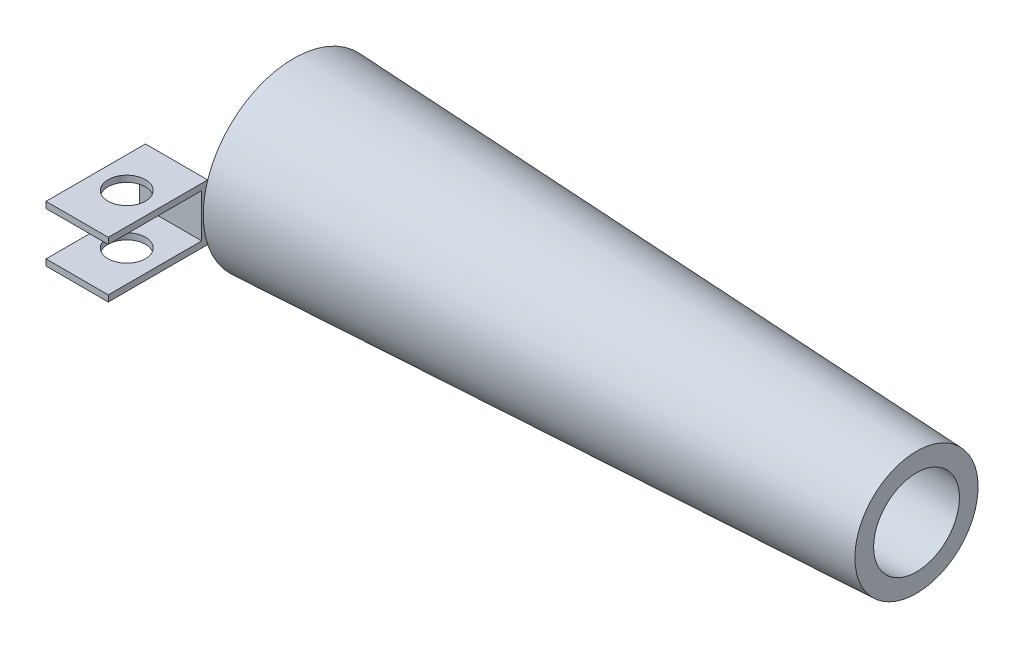
ISO-10303-21;
HEADER;
FILE_DESCRIPTION(('STEP AP214'),'2;1');
FILE_NAME('part.step','',(''),(''),'','','');
FILE_SCHEMA(('AUTOMOTIVE_DESIGN { 1 0 10303 214 1 1 1 1 }'));
ENDSEC;
DATA;
#1=APPLICATION_CONTEXT('core data for automotive mechanical design processes');
#2=APPLICATION_PROTOCOL_DEFINITION('international standard','automotive_design',2000,#1);
#3=PRODUCT_CONTEXT('',#1,'mechanical');
#4=PRODUCT('Part','Part','',(#3));
#5=PRODUCT_RELATED_PRODUCT_CATEGORY('part','',(#4));
#6=PRODUCT_DEFINITION_FORMATION('','',#4);
#7=PRODUCT_DEFINITION_CONTEXT('part definition',#1,'design');
#8=PRODUCT_DEFINITION('design','',#6,#7);
#9=PRODUCT_DEFINITION_SHAPE('','',#8);
#10=(LENGTH_UNIT() NAMED_UNIT(*) SI_UNIT(.MILLI.,.METRE.));
#11=(NAMED_UNIT(*) PLANE_ANGLE_UNIT() SI_UNIT($,.RADIAN.));
#12=(NAMED_UNIT(*) SI_UNIT($,.STERADIAN.) SOLID_ANGLE_UNIT());
#13=UNCERTAINTY_MEASURE_WITH_UNIT(LENGTH_MEASURE(1.E-05),#10,'distance_accuracy_value','');
#14=(GEOMETRIC_REPRESENTATION_CONTEXT(3) GLOBAL_UNCERTAINTY_ASSIGNED_CONTEXT((#13)) GLOBAL_UNIT_ASSIGNED_CONTEXT((#10,
#11,#12)) REPRESENTATION_CONTEXT('',''));
#15=CARTESIAN_POINT('',(0.,0.,0.));
#16=DIRECTION('',(0.,0.,1.));
#17=DIRECTION('',(1.,0.,0.));
#18=AXIS2_PLACEMENT_3D('',#15,#16,#17);
#19=CARTESIAN_POINT('',(-1.,0.,2.97456253599419));
#20=DIRECTION('',(0.,0.,1.));
#21=DIRECTION('',(1.,0.,0.));
#22=AXIS2_PLACEMENT_3D('',#19,#20,#21);
#23=PLANE('',#22);
#24=DIRECTION('',(-1.,0.,0.));
#25=VECTOR('',#24,1.);
#26=CARTESIAN_POINT('',(-1.,-0.1,2.97456253599419));
#27=LINE('',#26,#25);
#28=CARTESIAN_POINT('',(0.,-0.1,2.97456253599419));
#29=VERTEX_POINT('',#28);
#30=CARTESIAN_POINT('',(-1.,-0.1,2.97456253599419));
#31=VERTEX_POINT('',#30);
#32=EDGE_CURVE('E133',#29,#31,#27,.T.);
#33=ORIENTED_EDGE('',*,*,#32,.F.);
#34=DIRECTION('',(0.,-1.,0.));
#35=VECTOR('',#34,1.);
#36=CARTESIAN_POINT('',(0.,0.,2.97456253599419));
#37=LINE('',#36,#35);
#38=CARTESIAN_POINT('',(0.,0.,2.97456253599419));
#39=VERTEX_POINT('',#38);
#40=EDGE_CURVE('E167',#39,#29,#37,.T.);
#41=ORIENTED_EDGE('',*,*,#40,.F.);
#42=DIRECTION('',(1.,0.,0.));
#43=VECTOR('',#42,1.);
#44=CARTESIAN_POINT('',(-1.,0.,2.97456253599419));
#45=LINE('',#44,#43);
#46=CARTESIAN_POINT('',(-1.,0.,2.97456253599419));
#47=VERTEX_POINT('',#46);
#48=EDGE_CURVE('E173',#47,#39,#45,.T.);
#49=ORIENTED_EDGE('',*,*,#48,.F.);
#50=DIRECTION('',(0.,-1.,0.));
#51=VECTOR('',#50,1.);
#52=CARTESIAN_POINT('',(-1.,0.,2.97456253599419));
#53=LINE('',#52,#51);
#54=EDGE_CURVE('E157',#47,#31,#53,.T.);
#55=ORIENTED_EDGE('',*,*,#54,.T.);
#56=EDGE_LOOP('',(#33,#41,#49,#55));
#57=FACE_BOUND('',#56,.T.);
#58=ADVANCED_FACE('F46',(#57),#23,.T.);
#59=CARTESIAN_POINT('',(-0.503618209563683,-1.,2.17456253599419));
#60=DIRECTION('',(0.,1.,0.));
#61=DIRECTION('',(0.,0.,1.));
#62=AXIS2_PLACEMENT_3D('',#59,#60,#61);
#63=CYLINDRICAL_SURFACE('',#62,0.3);
#64=CARTESIAN_POINT('',(-0.503618209563683,-0.1,2.17456253599419));
#65=DIRECTION('',(0.,1.,0.));
#66=DIRECTION('',(0.,0.,1.));
#67=AXIS2_PLACEMENT_3D('',#64,#65,#66);
#68=CIRCLE('',#67,0.3);
#69=CARTESIAN_POINT('',(-0.503618209563683,-0.1,2.47456253599419));
#70=VERTEX_POINT('',#69);
#71=EDGE_CURVE('E50',#70,#70,#68,.F.);
#72=ORIENTED_EDGE('',*,*,#71,.T.);
#73=EDGE_LOOP('',(#72));
#74=FACE_BOUND('',#73,.T.);
#75=CARTESIAN_POINT('',(-0.503618209563683,0.,2.17456253599419));
#76=DIRECTION('',(0.,1.,0.));
#77=DIRECTION('',(0.,0.,1.));
#78=AXIS2_PLACEMENT_3D('',#75,#76,#77);
#79=CIRCLE('',#78,0.3);
#80=CARTESIAN_POINT('',(-0.503618209563683,0.,2.47456253599419));
#81=VERTEX_POINT('',#80);
#82=EDGE_CURVE('E145',#81,#81,#79,.T.);
#83=ORIENTED_EDGE('',*,*,#82,.T.);
#84=EDGE_LOOP('',(#83));
#85=FACE_BOUND('',#84,.T.);
#86=ADVANCED_FACE('F215',(#74,#85),#63,.F.);
#87=CARTESIAN_POINT('',(-1.,-0.45,0.));
#88=DIRECTION('',(1.,0.,0.));
#89=DIRECTION('',(0.,0.,-1.));
#90=AXIS2_PLACEMENT_3D('',#87,#88,#89);
#91=CYLINDRICAL_SURFACE('',#90,1.45);
#92=CARTESIAN_POINT('',(0.,-0.45,0.));
#93=DIRECTION('',(-1.,0.,0.));
#94=DIRECTION('',(0.,0.,1.));
#95=AXIS2_PLACEMENT_3D('',#92,#93,#94);
#96=CIRCLE('',#95,1.45);
#97=CARTESIAN_POINT('',(0.,-0.9,1.37840487520902));
#98=VERTEX_POINT('',#97);
#99=CARTESIAN_POINT('',(0.,0.,1.37840487520902));
#100=VERTEX_POINT('',#99);
#101=EDGE_CURVE('E151',#98,#100,#96,.T.);
#102=ORIENTED_EDGE('',*,*,#101,.F.);
#103=DIRECTION('',(1.,0.,0.));
#104=VECTOR('',#103,1.);
#105=CARTESIAN_POINT('',(-1.,-0.9,1.37840487520902));
#106=LINE('',#105,#104);
#107=CARTESIAN_POINT('',(-1.,-0.9,1.37840487520902));
#108=VERTEX_POINT('',#107);
#109=EDGE_CURVE('E12',#108,#98,#106,.T.);
#110=ORIENTED_EDGE('',*,*,#109,.F.);
#111=CARTESIAN_POINT('',(-1.,-0.45,0.));
#112=DIRECTION('',(-1.,0.,0.));
#113=DIRECTION('',(0.,0.,1.));
#114=AXIS2_PLACEMENT_3D('',#111,#112,#113);
#115=CIRCLE('',#114,1.45);
#116=CARTESIAN_POINT('',(-1.,0.,1.37840487520902));
#117=VERTEX_POINT('',#116);
#118=EDGE_CURVE('E152',#108,#117,#115,.T.);
#119=ORIENTED_EDGE('',*,*,#118,.T.);
#120=DIRECTION('',(1.,0.,0.));
#121=VECTOR('',#120,1.);
#122=CARTESIAN_POINT('',(-1.,0.,1.37840487520902));
#123=LINE('',#122,#121);
#124=EDGE_CURVE('E72',#117,#100,#123,.T.);
#125=ORIENTED_EDGE('',*,*,#124,.T.);
#126=EDGE_LOOP('',(#102,#110,#119,#125));
#127=FACE_BOUND('',#126,.T.);
#128=ADVANCED_FACE('F48',(#127),#91,.F.);
#129=CARTESIAN_POINT('',(-1.,-0.9,0.));
#130=DIRECTION('',(0.,1.,0.));
#131=DIRECTION('',(0.,0.,1.));
#132=AXIS2_PLACEMENT_3D('',#129,#130,#131);
#133=PLANE('',#132);
#134=CARTESIAN_POINT('',(-0.503618209563683,-0.9,2.17456253599419));
#135=DIRECTION('',(0.,1.,0.));
#136=DIRECTION('',(0.,0.,1.));
#137=AXIS2_PLACEMENT_3D('',#134,#135,#136);
#138=CIRCLE('',#137,0.3);
#139=CARTESIAN_POINT('',(-0.503618209563683,-0.9,2.47456253599419));
#140=VERTEX_POINT('',#139);
#141=EDGE_CURVE('E148',#140,#140,#138,.T.);
#142=ORIENTED_EDGE('',*,*,#141,.T.);
#143=EDGE_LOOP('',(#142));
#144=FACE_BOUND('',#143,.T.);
#145=DIRECTION('',(0.,0.,1.));
#146=VECTOR('',#145,1.);
#147=CARTESIAN_POINT('',(0.,-0.9,0.));
#148=LINE('',#147,#146);
#149=CARTESIAN_POINT('',(0.,-0.9,2.97456253599419));
#150=VERTEX_POINT('',#149);
#151=EDGE_CURVE('E163',#98,#150,#148,.T.);
#152=ORIENTED_EDGE('',*,*,#151,.T.);
#153=DIRECTION('',(1.,0.,0.));
#154=VECTOR('',#153,1.);
#155=CARTESIAN_POINT('',(-1.,-0.9,2.97456253599419));
#156=LINE('',#155,#154);
#157=CARTESIAN_POINT('',(-1.,-0.9,2.97456253599419));
#158=VERTEX_POINT('',#157);
#159=EDGE_CURVE('E55',#158,#150,#156,.T.);
#160=ORIENTED_EDGE('',*,*,#159,.F.);
#161=DIRECTION('',(0.,0.,1.));
#162=VECTOR('',#161,1.);
#163=CARTESIAN_POINT('',(-1.,-0.9,0.));
#164=LINE('',#163,#162);
#165=EDGE_CURVE('E154',#108,#158,#164,.T.);
#166=ORIENTED_EDGE('',*,*,#165,.F.);
#167=ORIENTED_EDGE('',*,*,#109,.T.);
#168=EDGE_LOOP('',(#152,#160,#166,#167));
#169=FACE_BOUND('',#168,.T.);
#170=ADVANCED_FACE('F209',(#144,#169),#133,.F.);
#171=DIRECTION('',(1.,0.,0.));
#172=VECTOR('',#171,1.);
#173=CARTESIAN_POINT('',(-1.,-0.8,2.97456253599419));
#174=LINE('',#173,#172);
#175=CARTESIAN_POINT('',(-1.,-0.8,2.97456253599419));
#176=VERTEX_POINT('',#175);
#177=CARTESIAN_POINT('',(0.,-0.8,2.97456253599419));
#178=VERTEX_POINT('',#177);
#179=EDGE_CURVE('E186',#176,#178,#174,.T.);
#180=ORIENTED_EDGE('',*,*,#179,.F.);
#181=EDGE_CURVE('E138',#176,#158,#53,.T.);
#182=ORIENTED_EDGE('',*,*,#181,.T.);
#183=ORIENTED_EDGE('',*,*,#159,.T.);
#184=EDGE_CURVE('E166',#178,#150,#37,.T.);
#185=ORIENTED_EDGE('',*,*,#184,.F.);
#186=EDGE_LOOP('',(#180,#182,#183,#185));
#187=FACE_BOUND('',#186,.T.);
#188=ADVANCED_FACE('F201',(#187),#23,.T.);
#189=CARTESIAN_POINT('',(-1.,0.,0.));
#190=DIRECTION('',(0.,1.,0.));
#191=DIRECTION('',(0.,0.,1.));
#192=AXIS2_PLACEMENT_3D('',#189,#190,#191);
#193=PLANE('',#192);
#194=ORIENTED_EDGE('',*,*,#82,.F.);
#195=EDGE_LOOP('',(#194));
#196=FACE_BOUND('',#195,.T.);
#197=DIRECTION('',(0.,0.,1.));
#198=VECTOR('',#197,1.);
#199=CARTESIAN_POINT('',(0.,0.,0.));
#200=LINE('',#199,#198);
#201=EDGE_CURVE('E155',#100,#39,#200,.T.);
#202=ORIENTED_EDGE('',*,*,#201,.F.);
#203=ORIENTED_EDGE('',*,*,#124,.F.);
#204=DIRECTION('',(0.,0.,1.));
#205=VECTOR('',#204,1.);
#206=CARTESIAN_POINT('',(-1.,0.,0.));
#207=LINE('',#206,#205);
#208=EDGE_CURVE('E160',#117,#47,#207,.T.);
#209=ORIENTED_EDGE('',*,*,#208,.T.);
#210=ORIENTED_EDGE('',*,*,#48,.T.);
#211=EDGE_LOOP('',(#202,#203,#209,#210));
#212=FACE_BOUND('',#211,.T.);
#213=ADVANCED_FACE('F199',(#196,#212),#193,.T.);
#214=CARTESIAN_POINT('',(-1.,0.,0.));
#215=DIRECTION('',(-1.,0.,0.));
#216=DIRECTION('',(0.,0.,1.));
#217=AXIS2_PLACEMENT_3D('',#214,#215,#216);
#218=PLANE('',#217);
#219=DIRECTION('',(0.,0.,1.));
#220=VECTOR('',#219,1.);
#221=CARTESIAN_POINT('',(-1.,-0.1,1.47456253599419));
#222=LINE('',#221,#220);
#223=CARTESIAN_POINT('',(-1.,-0.1,1.47456253599419));
#224=VERTEX_POINT('',#223);
#225=EDGE_CURVE('E178',#224,#31,#222,.T.);
#226=ORIENTED_EDGE('',*,*,#225,.T.);
#227=ORIENTED_EDGE('',*,*,#54,.F.);
#228=ORIENTED_EDGE('',*,*,#208,.F.);
#229=ORIENTED_EDGE('',*,*,#118,.F.);
#230=ORIENTED_EDGE('',*,*,#165,.T.);
#231=ORIENTED_EDGE('',*,*,#181,.F.);
#232=DIRECTION('',(0.,0.,1.));
#233=VECTOR('',#232,1.);
#234=CARTESIAN_POINT('',(-1.,-0.8,1.47456253599419));
#235=LINE('',#234,#233);
#236=CARTESIAN_POINT('',(-1.,-0.8,1.47456253599419));
#237=VERTEX_POINT('',#236);
#238=EDGE_CURVE('E118',#237,#176,#235,.T.);
#239=ORIENTED_EDGE('',*,*,#238,.F.);
#240=DIRECTION('',(0.,-1.,0.));
#241=VECTOR('',#240,1.);
#242=CARTESIAN_POINT('',(-1.,-0.1,1.47456253599419));
#243=LINE('',#242,#241);
#244=EDGE_CURVE('E124',#224,#237,#243,.T.);
#245=ORIENTED_EDGE('',*,*,#244,.F.);
#246=EDGE_LOOP('',(#226,#227,#228,#229,#230,#231,#239,#245));
#247=FACE_BOUND('',#246,.T.);
#248=ADVANCED_FACE('F136',(#247),#218,.T.);
#249=CARTESIAN_POINT('',(0.,0.,0.));
#250=DIRECTION('',(-1.,0.,0.));
#251=DIRECTION('',(0.,0.,1.));
#252=AXIS2_PLACEMENT_3D('',#249,#250,#251);
#253=PLANE('',#252);
#254=ORIENTED_EDGE('',*,*,#40,.T.);
#255=DIRECTION('',(0.,0.,1.));
#256=VECTOR('',#255,1.);
#257=CARTESIAN_POINT('',(0.,-0.1,1.47456253599419));
#258=LINE('',#257,#256);
#259=CARTESIAN_POINT('',(0.,-0.1,1.47456253599419));
#260=VERTEX_POINT('',#259);
#261=EDGE_CURVE('E140',#260,#29,#258,.T.);
#262=ORIENTED_EDGE('',*,*,#261,.F.);
#263=DIRECTION('',(0.,1.,0.));
#264=VECTOR('',#263,1.);
#265=CARTESIAN_POINT('',(0.,-0.1,1.47456253599419));
#266=LINE('',#265,#264);
#267=CARTESIAN_POINT('',(0.,-0.8,1.47456253599419));
#268=VERTEX_POINT('',#267);
#269=EDGE_CURVE('E123',#268,#260,#266,.T.);
#270=ORIENTED_EDGE('',*,*,#269,.F.);
#271=DIRECTION('',(0.,0.,1.));
#272=VECTOR('',#271,1.);
#273=CARTESIAN_POINT('',(0.,-0.8,1.47456253599419));
#274=LINE('',#273,#272);
#275=EDGE_CURVE('E121',#268,#178,#274,.T.);
#276=ORIENTED_EDGE('',*,*,#275,.T.);
#277=ORIENTED_EDGE('',*,*,#184,.T.);
#278=ORIENTED_EDGE('',*,*,#151,.F.);
#279=ORIENTED_EDGE('',*,*,#101,.T.);
#280=ORIENTED_EDGE('',*,*,#201,.T.);
#281=EDGE_LOOP('',(#254,#262,#270,#276,#277,#278,#279,#280));
#282=FACE_BOUND('',#281,.T.);
#283=ADVANCED_FACE('F194',(#282),#253,.F.);
#284=CARTESIAN_POINT('',(-0.503618209563683,-0.8,2.17456253599419));
#285=DIRECTION('',(0.,-1.,0.));
#286=DIRECTION('',(0.,0.,-1.));
#287=AXIS2_PLACEMENT_3D('',#284,#285,#286);
#288=CIRCLE('',#287,0.3);
#289=CARTESIAN_POINT('',(-0.503618209563683,-0.8,1.87456253599419));
#290=VERTEX_POINT('',#289);
#291=EDGE_CURVE('E176',#290,#290,#288,.F.);
#292=ORIENTED_EDGE('',*,*,#291,.T.);
#293=EDGE_LOOP('',(#292));
#294=FACE_BOUND('',#293,.T.);
#295=ORIENTED_EDGE('',*,*,#141,.F.);
#296=EDGE_LOOP('',(#295));
#297=FACE_BOUND('',#296,.T.);
#298=ADVANCED_FACE('F221',(#294,#297),#63,.F.);
#299=CARTESIAN_POINT('',(-1.,-0.1,1.47456253599419));
#300=DIRECTION('',(0.,1.,0.));
#301=DIRECTION('',(0.,0.,1.));
#302=AXIS2_PLACEMENT_3D('',#299,#300,#301);
#303=PLANE('',#302);
#304=ORIENTED_EDGE('',*,*,#32,.T.);
#305=ORIENTED_EDGE('',*,*,#225,.F.);
#306=DIRECTION('',(-1.,0.,0.));
#307=VECTOR('',#306,1.);
#308=CARTESIAN_POINT('',(-1.,-0.1,1.47456253599419));
#309=LINE('',#308,#307);
#310=EDGE_CURVE('E130',#260,#224,#309,.T.);
#311=ORIENTED_EDGE('',*,*,#310,.F.);
#312=ORIENTED_EDGE('',*,*,#261,.T.);
#313=EDGE_LOOP('',(#304,#305,#311,#312));
#314=FACE_BOUND('',#313,.T.);
#315=ORIENTED_EDGE('',*,*,#71,.F.);
#316=EDGE_LOOP('',(#315));
#317=FACE_BOUND('',#316,.T.);
#318=ADVANCED_FACE('F191',(#314,#317),#303,.F.);
#319=CARTESIAN_POINT('',(-1.,-0.8,1.47456253599419));
#320=DIRECTION('',(0.,-1.,0.));
#321=DIRECTION('',(0.,0.,-1.));
#322=AXIS2_PLACEMENT_3D('',#319,#320,#321);
#323=PLANE('',#322);
#324=ORIENTED_EDGE('',*,*,#179,.T.);
#325=ORIENTED_EDGE('',*,*,#275,.F.);
#326=DIRECTION('',(1.,0.,0.));
#327=VECTOR('',#326,1.);
#328=CARTESIAN_POINT('',(-1.,-0.8,1.47456253599419));
#329=LINE('',#328,#327);
#330=EDGE_CURVE('E63',#237,#268,#329,.T.);
#331=ORIENTED_EDGE('',*,*,#330,.F.);
#332=ORIENTED_EDGE('',*,*,#238,.T.);
#333=EDGE_LOOP('',(#324,#325,#331,#332));
#334=FACE_BOUND('',#333,.T.);
#335=ORIENTED_EDGE('',*,*,#291,.F.);
#336=EDGE_LOOP('',(#335));
#337=FACE_BOUND('',#336,.T.);
#338=ADVANCED_FACE('F115',(#334,#337),#323,.F.);
#339=CARTESIAN_POINT('',(0.,0.,1.47456253599419));
#340=DIRECTION('',(0.,0.,1.));
#341=DIRECTION('',(1.,0.,0.));
#342=AXIS2_PLACEMENT_3D('',#339,#340,#341);
#343=PLANE('',#342);
#344=ORIENTED_EDGE('',*,*,#244,.T.);
#345=ORIENTED_EDGE('',*,*,#330,.T.);
#346=ORIENTED_EDGE('',*,*,#269,.T.);
#347=ORIENTED_EDGE('',*,*,#310,.T.);
#348=EDGE_LOOP('',(#344,#345,#346,#347));
#349=FACE_BOUND('',#348,.T.);
#350=ADVANCED_FACE('F128',(#349),#343,.T.);
#351=CLOSED_SHELL('',(#58,#86,#128,#170,#188,#213,#248,#283,#298,#318,#338,#350));
#352=MANIFOLD_SOLID_BREP('B2',#351);
#353=CARTESIAN_POINT('',(0.3,0.,0.));
#354=DIRECTION('',(-1.,0.,0.));
#355=DIRECTION('',(0.,0.,1.));
#356=AXIS2_PLACEMENT_3D('',#353,#354,#355);
#357=PLANE('',#356);
#358=CARTESIAN_POINT('',(0.3,-0.45,0.));
#359=DIRECTION('',(-1.,0.,0.));
#360=DIRECTION('',(0.,0.,1.));
#361=AXIS2_PLACEMENT_3D('',#358,#359,#360);
#362=CIRCLE('',#361,1.13585997009335);
#363=CARTESIAN_POINT('',(0.3,-0.45,1.13585997009335));
#364=VERTEX_POINT('',#363);
#365=EDGE_CURVE('E45',#364,#364,#362,.T.);
#366=ORIENTED_EDGE('',*,*,#365,.F.);
#367=EDGE_LOOP('',(#366));
#368=FACE_BOUND('',#367,.T.);
#369=CARTESIAN_POINT('',(0.3,-0.45,0.));
#370=DIRECTION('',(-1.,0.,0.));
#371=DIRECTION('',(0.,0.,1.));
#372=AXIS2_PLACEMENT_3D('',#369,#370,#371);
#373=CIRCLE('',#372,0.75);
#374=CARTESIAN_POINT('',(0.3,-0.45,0.75));
#375=VERTEX_POINT('',#374);
#376=EDGE_CURVE('E336',#375,#375,#373,.T.);
#377=ORIENTED_EDGE('',*,*,#376,.T.);
#378=EDGE_LOOP('',(#377));
#379=FACE_BOUND('',#378,.T.);
#380=ADVANCED_FACE('F314',(#368,#379),#357,.F.);
#381=CARTESIAN_POINT('',(0.3,-0.45,0.));
#382=DIRECTION('',(-1.,0.,0.));
#383=DIRECTION('',(0.,0.,1.));
#384=AXIS2_PLACEMENT_3D('',#381,#382,#383);
#385=CONICAL_SURFACE('',#384,1.13585997009335,0.0460400932135195);
#386=CARTESIAN_POINT('',(10.,-0.45,0.));
#387=DIRECTION('',(-1.,0.,0.));
#388=DIRECTION('',(0.,0.,1.));
#389=AXIS2_PLACEMENT_3D('',#386,#387,#388);
#390=CIRCLE('',#389,0.688955254778773);
#391=CARTESIAN_POINT('',(10.,-0.45,0.688955254778773));
#392=VERTEX_POINT('',#391);
#393=EDGE_CURVE('E320',#392,#392,#390,.T.);
#394=ORIENTED_EDGE('',*,*,#393,.F.);
#395=EDGE_LOOP('',(#394));
#396=FACE_BOUND('',#395,.T.);
#397=ORIENTED_EDGE('',*,*,#365,.T.);
#398=EDGE_LOOP('',(#397));
#399=FACE_BOUND('',#398,.T.);
#400=ADVANCED_FACE('F353',(#396,#399),#385,.F.);
#401=CARTESIAN_POINT('',(10.,0.,0.));
#402=DIRECTION('',(1.,0.,0.));
#403=DIRECTION('',(0.,0.,-1.));
#404=AXIS2_PLACEMENT_3D('',#401,#402,#403);
#405=PLANE('',#404);
#406=ORIENTED_EDGE('',*,*,#393,.T.);
#407=EDGE_LOOP('',(#406));
#408=FACE_BOUND('',#407,.T.);
#409=CARTESIAN_POINT('',(10.,-0.45,0.));
#410=DIRECTION('',(-1.,0.,0.));
#411=DIRECTION('',(0.,0.,1.));
#412=AXIS2_PLACEMENT_3D('',#409,#410,#411);
#413=CIRCLE('',#412,0.989273489366419);
#414=CARTESIAN_POINT('',(10.,-0.45,0.989273489366419));
#415=VERTEX_POINT('',#414);
#416=EDGE_CURVE('E324',#415,#415,#413,.T.);
#417=ORIENTED_EDGE('',*,*,#416,.F.);
#418=EDGE_LOOP('',(#417));
#419=FACE_BOUND('',#418,.T.);
#420=ADVANCED_FACE('F358',(#408,#419),#405,.T.);
#421=CARTESIAN_POINT('',(0.,-0.45,0.));
#422=DIRECTION('',(-1.,0.,0.));
#423=DIRECTION('',(0.,0.,1.));
#424=AXIS2_PLACEMENT_3D('',#421,#422,#423);
#425=CONICAL_SURFACE('',#424,1.45,0.0460400932135195);
#426=ORIENTED_EDGE('',*,*,#416,.T.);
#427=EDGE_LOOP('',(#426));
#428=FACE_BOUND('',#427,.T.);
#429=CARTESIAN_POINT('',(0.,-0.45,0.));
#430=DIRECTION('',(-1.,0.,0.));
#431=DIRECTION('',(0.,0.,1.));
#432=AXIS2_PLACEMENT_3D('',#429,#430,#431);
#433=CIRCLE('',#432,1.45);
#434=CARTESIAN_POINT('',(0.,-0.45,1.45));
#435=VERTEX_POINT('',#434);
#436=EDGE_CURVE('E328',#435,#435,#433,.T.);
#437=ORIENTED_EDGE('',*,*,#436,.F.);
#438=EDGE_LOOP('',(#437));
#439=FACE_BOUND('',#438,.T.);
#440=ADVANCED_FACE('F349',(#428,#439),#425,.T.);
#441=CARTESIAN_POINT('',(0.,0.,0.));
#442=DIRECTION('',(-1.,0.,0.));
#443=DIRECTION('',(0.,0.,1.));
#444=AXIS2_PLACEMENT_3D('',#441,#442,#443);
#445=PLANE('',#444);
#446=ORIENTED_EDGE('',*,*,#436,.T.);
#447=EDGE_LOOP('',(#446));
#448=FACE_BOUND('',#447,.T.);
#449=CARTESIAN_POINT('',(0.,-0.45,0.));
#450=DIRECTION('',(-1.,0.,0.));
#451=DIRECTION('',(0.,0.,1.));
#452=AXIS2_PLACEMENT_3D('',#449,#450,#451);
#453=CIRCLE('',#452,0.75);
#454=CARTESIAN_POINT('',(0.,-0.45,0.75));
#455=VERTEX_POINT('',#454);
#456=EDGE_CURVE('E333',#455,#455,#453,.T.);
#457=ORIENTED_EDGE('',*,*,#456,.F.);
#458=EDGE_LOOP('',(#457));
#459=FACE_BOUND('',#458,.T.);
#460=ADVANCED_FACE('F343',(#448,#459),#445,.T.);
#461=CARTESIAN_POINT('',(0.,-0.45,0.));
#462=DIRECTION('',(-1.,0.,0.));
#463=DIRECTION('',(0.,0.,1.));
#464=AXIS2_PLACEMENT_3D('',#461,#462,#463);
#465=CYLINDRICAL_SURFACE('',#464,0.75);
#466=ORIENTED_EDGE('',*,*,#456,.T.);
#467=EDGE_LOOP('',(#466));
#468=FACE_BOUND('',#467,.T.);
#469=ORIENTED_EDGE('',*,*,#376,.F.);
#470=EDGE_LOOP('',(#469));
#471=FACE_BOUND('',#470,.T.);
#472=ADVANCED_FACE('F341',(#468,#471),#465,.F.);
#473=CLOSED_SHELL('',(#380,#400,#420,#440,#460,#472));
#474=MANIFOLD_SOLID_BREP('B6',#473);
#475=ADVANCED_BREP_SHAPE_REPRESENTATION('',(#18,#352,#474),#14);
#476=SHAPE_DEFINITION_REPRESENTATION(#9,#475);
ENDSEC;
END-ISO-10303-21;
